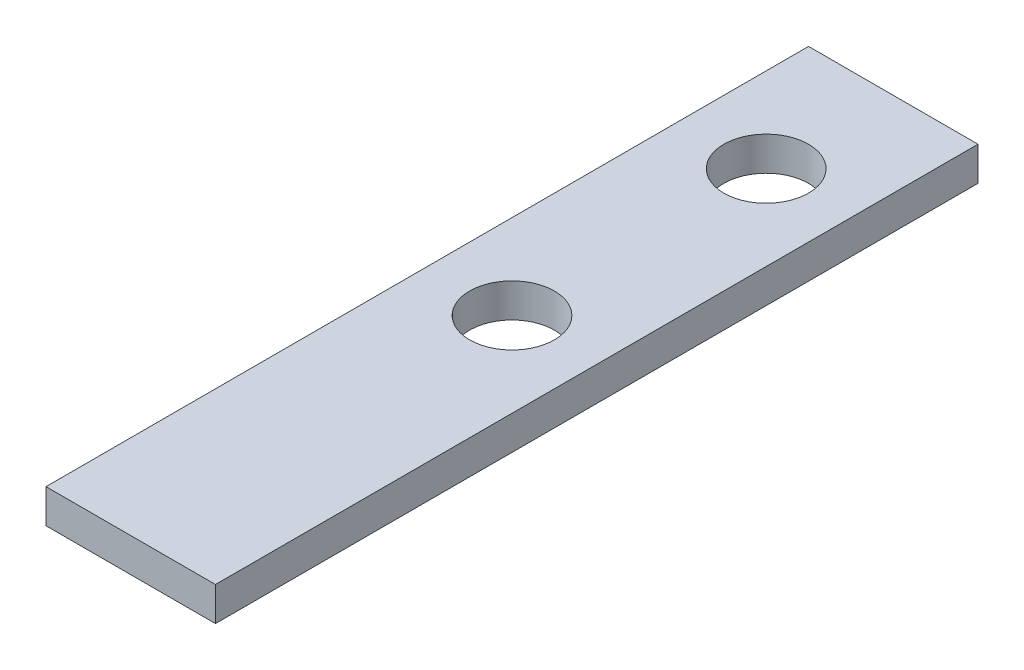
ISO-10303-21;
HEADER;
FILE_DESCRIPTION(('STEP AP214'),'2;1');
FILE_NAME('part.step','',(''),(''),'','','');
FILE_SCHEMA(('AUTOMOTIVE_DESIGN { 1 0 10303 214 1 1 1 1 }'));
ENDSEC;
DATA;
#1=APPLICATION_CONTEXT('core data for automotive mechanical design processes');
#2=APPLICATION_PROTOCOL_DEFINITION('international standard','automotive_design',2000,#1);
#3=PRODUCT_CONTEXT('',#1,'mechanical');
#4=PRODUCT('Part','Part','',(#3));
#5=PRODUCT_RELATED_PRODUCT_CATEGORY('part','',(#4));
#6=PRODUCT_DEFINITION_FORMATION('','',#4);
#7=PRODUCT_DEFINITION_CONTEXT('part definition',#1,'design');
#8=PRODUCT_DEFINITION('design','',#6,#7);
#9=PRODUCT_DEFINITION_SHAPE('','',#8);
#10=(LENGTH_UNIT() NAMED_UNIT(*) SI_UNIT(.MILLI.,.METRE.));
#11=(NAMED_UNIT(*) PLANE_ANGLE_UNIT() SI_UNIT($,.RADIAN.));
#12=(NAMED_UNIT(*) SI_UNIT($,.STERADIAN.) SOLID_ANGLE_UNIT());
#13=UNCERTAINTY_MEASURE_WITH_UNIT(LENGTH_MEASURE(1.E-05),#10,'distance_accuracy_value','');
#14=(GEOMETRIC_REPRESENTATION_CONTEXT(3) GLOBAL_UNCERTAINTY_ASSIGNED_CONTEXT((#13)) GLOBAL_UNIT_ASSIGNED_CONTEXT((#10,
#11,#12)) REPRESENTATION_CONTEXT('',''));
#15=CARTESIAN_POINT('',(0.,0.,0.));
#16=DIRECTION('',(0.,0.,1.));
#17=DIRECTION('',(1.,0.,0.));
#18=AXIS2_PLACEMENT_3D('',#15,#16,#17);
#19=CARTESIAN_POINT('',(0.,4.,0.));
#20=DIRECTION('',(0.,-1.,0.));
#21=DIRECTION('',(0.,0.,-1.));
#22=AXIS2_PLACEMENT_3D('',#19,#20,#21);
#23=PLANE('',#22);
#24=DIRECTION('',(0.,0.,1.));
#25=VECTOR('',#24,1.);
#26=CARTESIAN_POINT('',(0.,4.,0.));
#27=LINE('',#26,#25);
#28=CARTESIAN_POINT('',(0.,4.,-90.));
#29=VERTEX_POINT('',#28);
#30=CARTESIAN_POINT('',(0.,4.,0.));
#31=VERTEX_POINT('',#30);
#32=EDGE_CURVE('E86',#29,#31,#27,.T.);
#33=ORIENTED_EDGE('',*,*,#32,.T.);
#34=DIRECTION('',(1.,0.,0.));
#35=VECTOR('',#34,1.);
#36=CARTESIAN_POINT('',(0.,4.,0.));
#37=LINE('',#36,#35);
#38=CARTESIAN_POINT('',(20.,4.,0.));
#39=VERTEX_POINT('',#38);
#40=EDGE_CURVE('E81',#31,#39,#37,.T.);
#41=ORIENTED_EDGE('',*,*,#40,.T.);
#42=DIRECTION('',(0.,0.,-1.));
#43=VECTOR('',#42,1.);
#44=CARTESIAN_POINT('',(20.,4.,0.));
#45=LINE('',#44,#43);
#46=CARTESIAN_POINT('',(20.,4.,-90.));
#47=VERTEX_POINT('',#46);
#48=EDGE_CURVE('E84',#39,#47,#45,.T.);
#49=ORIENTED_EDGE('',*,*,#48,.T.);
#50=DIRECTION('',(-1.,0.,0.));
#51=VECTOR('',#50,1.);
#52=CARTESIAN_POINT('',(0.,4.,-90.));
#53=LINE('',#52,#51);
#54=EDGE_CURVE('E51',#47,#29,#53,.T.);
#55=ORIENTED_EDGE('',*,*,#54,.T.);
#56=EDGE_LOOP('',(#33,#41,#49,#55));
#57=FACE_BOUND('',#56,.T.);
#58=CARTESIAN_POINT('',(10.,4.,-45.));
#59=DIRECTION('',(0.,1.,0.));
#60=DIRECTION('',(0.,0.,1.));
#61=AXIS2_PLACEMENT_3D('',#58,#59,#60);
#62=CIRCLE('',#61,5.00000000000001);
#63=CARTESIAN_POINT('',(10.,4.,-40.));
#64=VERTEX_POINT('',#63);
#65=EDGE_CURVE('E101',#64,#64,#62,.T.);
#66=ORIENTED_EDGE('',*,*,#65,.F.);
#67=EDGE_LOOP('',(#66));
#68=FACE_BOUND('',#67,.T.);
#69=CARTESIAN_POINT('',(9.9999999999999,4.,-75.));
#70=DIRECTION('',(0.,1.,0.));
#71=DIRECTION('',(0.,0.,1.));
#72=AXIS2_PLACEMENT_3D('',#69,#70,#71);
#73=CIRCLE('',#72,5.00000000000001);
#74=CARTESIAN_POINT('',(9.9999999999999,4.,-70.));
#75=VERTEX_POINT('',#74);
#76=EDGE_CURVE('E116',#75,#75,#73,.T.);
#77=ORIENTED_EDGE('',*,*,#76,.F.);
#78=EDGE_LOOP('',(#77));
#79=FACE_BOUND('',#78,.T.);
#80=ADVANCED_FACE('F34',(#57,#68,#79),#23,.F.);
#81=CARTESIAN_POINT('',(0.,0.,0.));
#82=DIRECTION('',(0.,-1.,0.));
#83=DIRECTION('',(0.,0.,-1.));
#84=AXIS2_PLACEMENT_3D('',#81,#82,#83);
#85=PLANE('',#84);
#86=CARTESIAN_POINT('',(10.,0.,-45.));
#87=DIRECTION('',(0.,1.,0.));
#88=DIRECTION('',(0.,0.,1.));
#89=AXIS2_PLACEMENT_3D('',#86,#87,#88);
#90=CIRCLE('',#89,5.00000000000001);
#91=CARTESIAN_POINT('',(10.,0.,-40.));
#92=VERTEX_POINT('',#91);
#93=EDGE_CURVE('E113',#92,#92,#90,.T.);
#94=ORIENTED_EDGE('',*,*,#93,.T.);
#95=EDGE_LOOP('',(#94));
#96=FACE_BOUND('',#95,.T.);
#97=DIRECTION('',(0.,0.,1.));
#98=VECTOR('',#97,1.);
#99=CARTESIAN_POINT('',(0.,0.,0.));
#100=LINE('',#99,#98);
#101=CARTESIAN_POINT('',(0.,0.,-90.));
#102=VERTEX_POINT('',#101);
#103=CARTESIAN_POINT('',(0.,0.,0.));
#104=VERTEX_POINT('',#103);
#105=EDGE_CURVE('E98',#102,#104,#100,.T.);
#106=ORIENTED_EDGE('',*,*,#105,.F.);
#107=DIRECTION('',(-1.,0.,0.));
#108=VECTOR('',#107,1.);
#109=CARTESIAN_POINT('',(0.,0.,-90.));
#110=LINE('',#109,#108);
#111=CARTESIAN_POINT('',(20.,0.,-90.));
#112=VERTEX_POINT('',#111);
#113=EDGE_CURVE('E74',#112,#102,#110,.T.);
#114=ORIENTED_EDGE('',*,*,#113,.F.);
#115=DIRECTION('',(0.,0.,-1.));
#116=VECTOR('',#115,1.);
#117=CARTESIAN_POINT('',(20.,0.,0.));
#118=LINE('',#117,#116);
#119=CARTESIAN_POINT('',(20.,0.,0.));
#120=VERTEX_POINT('',#119);
#121=EDGE_CURVE('E68',#120,#112,#118,.T.);
#122=ORIENTED_EDGE('',*,*,#121,.F.);
#123=DIRECTION('',(1.,0.,0.));
#124=VECTOR('',#123,1.);
#125=CARTESIAN_POINT('',(0.,0.,0.));
#126=LINE('',#125,#124);
#127=EDGE_CURVE('E90',#104,#120,#126,.T.);
#128=ORIENTED_EDGE('',*,*,#127,.F.);
#129=EDGE_LOOP('',(#106,#114,#122,#128));
#130=FACE_BOUND('',#129,.T.);
#131=CARTESIAN_POINT('',(9.9999999999999,0.,-75.));
#132=DIRECTION('',(0.,1.,0.));
#133=DIRECTION('',(0.,0.,1.));
#134=AXIS2_PLACEMENT_3D('',#131,#132,#133);
#135=CIRCLE('',#134,5.00000000000001);
#136=CARTESIAN_POINT('',(9.9999999999999,0.,-70.));
#137=VERTEX_POINT('',#136);
#138=EDGE_CURVE('E119',#137,#137,#135,.T.);
#139=ORIENTED_EDGE('',*,*,#138,.T.);
#140=EDGE_LOOP('',(#139));
#141=FACE_BOUND('',#140,.T.);
#142=ADVANCED_FACE('F109',(#96,#130,#141),#85,.T.);
#143=CARTESIAN_POINT('',(0.,4.,0.));
#144=DIRECTION('',(1.,0.,0.));
#145=DIRECTION('',(0.,0.,-1.));
#146=AXIS2_PLACEMENT_3D('',#143,#144,#145);
#147=PLANE('',#146);
#148=ORIENTED_EDGE('',*,*,#105,.T.);
#149=DIRECTION('',(0.,-1.,0.));
#150=VECTOR('',#149,1.);
#151=CARTESIAN_POINT('',(0.,4.,0.));
#152=LINE('',#151,#150);
#153=EDGE_CURVE('E11',#31,#104,#152,.T.);
#154=ORIENTED_EDGE('',*,*,#153,.F.);
#155=ORIENTED_EDGE('',*,*,#32,.F.);
#156=DIRECTION('',(0.,-1.,0.));
#157=VECTOR('',#156,1.);
#158=CARTESIAN_POINT('',(0.,4.,-90.));
#159=LINE('',#158,#157);
#160=EDGE_CURVE('E94',#29,#102,#159,.T.);
#161=ORIENTED_EDGE('',*,*,#160,.T.);
#162=EDGE_LOOP('',(#148,#154,#155,#161));
#163=FACE_BOUND('',#162,.T.);
#164=ADVANCED_FACE('F36',(#163),#147,.F.);
#165=CARTESIAN_POINT('',(0.,4.,0.));
#166=DIRECTION('',(0.,0.,-1.));
#167=DIRECTION('',(-1.,0.,0.));
#168=AXIS2_PLACEMENT_3D('',#165,#166,#167);
#169=PLANE('',#168);
#170=ORIENTED_EDGE('',*,*,#127,.T.);
#171=DIRECTION('',(0.,-1.,0.));
#172=VECTOR('',#171,1.);
#173=CARTESIAN_POINT('',(20.,4.,0.));
#174=LINE('',#173,#172);
#175=EDGE_CURVE('E43',#39,#120,#174,.T.);
#176=ORIENTED_EDGE('',*,*,#175,.F.);
#177=ORIENTED_EDGE('',*,*,#40,.F.);
#178=ORIENTED_EDGE('',*,*,#153,.T.);
#179=EDGE_LOOP('',(#170,#176,#177,#178));
#180=FACE_BOUND('',#179,.T.);
#181=ADVANCED_FACE('F89',(#180),#169,.F.);
#182=CARTESIAN_POINT('',(20.,4.,0.));
#183=DIRECTION('',(-1.,0.,0.));
#184=DIRECTION('',(0.,0.,1.));
#185=AXIS2_PLACEMENT_3D('',#182,#183,#184);
#186=PLANE('',#185);
#187=ORIENTED_EDGE('',*,*,#121,.T.);
#188=DIRECTION('',(0.,-1.,0.));
#189=VECTOR('',#188,1.);
#190=CARTESIAN_POINT('',(20.,4.,-90.));
#191=LINE('',#190,#189);
#192=EDGE_CURVE('E91',#47,#112,#191,.T.);
#193=ORIENTED_EDGE('',*,*,#192,.F.);
#194=ORIENTED_EDGE('',*,*,#48,.F.);
#195=ORIENTED_EDGE('',*,*,#175,.T.);
#196=EDGE_LOOP('',(#187,#193,#194,#195));
#197=FACE_BOUND('',#196,.T.);
#198=ADVANCED_FACE('F92',(#197),#186,.F.);
#199=CARTESIAN_POINT('',(0.,4.,-90.));
#200=DIRECTION('',(0.,0.,1.));
#201=DIRECTION('',(1.,0.,0.));
#202=AXIS2_PLACEMENT_3D('',#199,#200,#201);
#203=PLANE('',#202);
#204=ORIENTED_EDGE('',*,*,#113,.T.);
#205=ORIENTED_EDGE('',*,*,#160,.F.);
#206=ORIENTED_EDGE('',*,*,#54,.F.);
#207=ORIENTED_EDGE('',*,*,#192,.T.);
#208=EDGE_LOOP('',(#204,#205,#206,#207));
#209=FACE_BOUND('',#208,.T.);
#210=ADVANCED_FACE('F106',(#209),#203,.F.);
#211=CARTESIAN_POINT('',(10.,4.,-45.));
#212=DIRECTION('',(0.,-1.,0.));
#213=DIRECTION('',(0.,0.,-1.));
#214=AXIS2_PLACEMENT_3D('',#211,#212,#213);
#215=CYLINDRICAL_SURFACE('',#214,5.00000000000001);
#216=ORIENTED_EDGE('',*,*,#65,.T.);
#217=EDGE_LOOP('',(#216));
#218=FACE_BOUND('',#217,.T.);
#219=ORIENTED_EDGE('',*,*,#93,.F.);
#220=EDGE_LOOP('',(#219));
#221=FACE_BOUND('',#220,.T.);
#222=ADVANCED_FACE('F136',(#218,#221),#215,.F.);
#223=CARTESIAN_POINT('',(9.9999999999999,4.,-75.));
#224=DIRECTION('',(0.,-1.,0.));
#225=DIRECTION('',(0.,0.,-1.));
#226=AXIS2_PLACEMENT_3D('',#223,#224,#225);
#227=CYLINDRICAL_SURFACE('',#226,5.00000000000001);
#228=ORIENTED_EDGE('',*,*,#76,.T.);
#229=EDGE_LOOP('',(#228));
#230=FACE_BOUND('',#229,.T.);
#231=ORIENTED_EDGE('',*,*,#138,.F.);
#232=EDGE_LOOP('',(#231));
#233=FACE_BOUND('',#232,.T.);
#234=ADVANCED_FACE('F125',(#230,#233),#227,.F.);
#235=CLOSED_SHELL('',(#80,#142,#164,#181,#198,#210,#222,#234));
#236=MANIFOLD_SOLID_BREP('B2',#235);
#237=ADVANCED_BREP_SHAPE_REPRESENTATION('',(#18,#236),#14);
#238=SHAPE_DEFINITION_REPRESENTATION(#9,#237);
ENDSEC;
END-ISO-10303-21;
